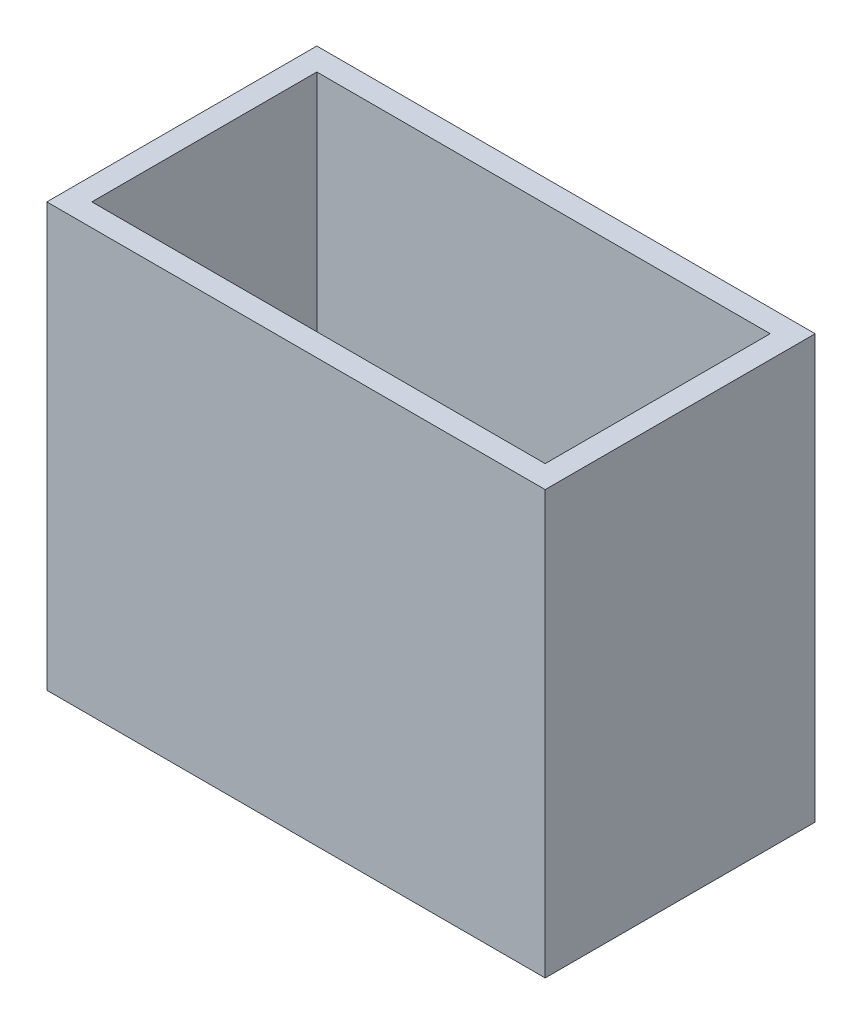
ISO-10303-21;
HEADER;
FILE_DESCRIPTION(('STEP AP214'),'2;1');
FILE_NAME('part.step','',(''),(''),'','','');
FILE_SCHEMA(('AUTOMOTIVE_DESIGN { 1 0 10303 214 1 1 1 1 }'));
ENDSEC;
DATA;
#1=APPLICATION_CONTEXT('core data for automotive mechanical design processes');
#2=APPLICATION_PROTOCOL_DEFINITION('international standard','automotive_design',2000,#1);
#3=PRODUCT_CONTEXT('',#1,'mechanical');
#4=PRODUCT('Part','Part','',(#3));
#5=PRODUCT_RELATED_PRODUCT_CATEGORY('part','',(#4));
#6=PRODUCT_DEFINITION_FORMATION('','',#4);
#7=PRODUCT_DEFINITION_CONTEXT('part definition',#1,'design');
#8=PRODUCT_DEFINITION('design','',#6,#7);
#9=PRODUCT_DEFINITION_SHAPE('','',#8);
#10=(LENGTH_UNIT() NAMED_UNIT(*) SI_UNIT(.MILLI.,.METRE.));
#11=(NAMED_UNIT(*) PLANE_ANGLE_UNIT() SI_UNIT($,.RADIAN.));
#12=(NAMED_UNIT(*) SI_UNIT($,.STERADIAN.) SOLID_ANGLE_UNIT());
#13=UNCERTAINTY_MEASURE_WITH_UNIT(LENGTH_MEASURE(1.E-05),#10,'distance_accuracy_value','');
#14=(GEOMETRIC_REPRESENTATION_CONTEXT(3) GLOBAL_UNCERTAINTY_ASSIGNED_CONTEXT((#13)) GLOBAL_UNIT_ASSIGNED_CONTEXT((#10,
#11,#12)) REPRESENTATION_CONTEXT('',''));
#15=CARTESIAN_POINT('',(0.,0.,0.));
#16=DIRECTION('',(0.,0.,1.));
#17=DIRECTION('',(1.,0.,0.));
#18=AXIS2_PLACEMENT_3D('',#15,#16,#17);
#19=CARTESIAN_POINT('',(0.,0.,24.));
#20=DIRECTION('',(1.,0.,0.));
#21=DIRECTION('',(0.,0.,-1.));
#22=AXIS2_PLACEMENT_3D('',#19,#20,#21);
#23=PLANE('',#22);
#24=DIRECTION('',(0.,-1.,0.));
#25=VECTOR('',#24,1.);
#26=CARTESIAN_POINT('',(0.,0.,0.));
#27=LINE('',#26,#25);
#28=CARTESIAN_POINT('',(0.,37.6,0.));
#29=VERTEX_POINT('',#28);
#30=CARTESIAN_POINT('',(0.,0.,0.));
#31=VERTEX_POINT('',#30);
#32=EDGE_CURVE('E160',#29,#31,#27,.T.);
#33=ORIENTED_EDGE('',*,*,#32,.T.);
#34=DIRECTION('',(0.,0.,-1.));
#35=VECTOR('',#34,1.);
#36=CARTESIAN_POINT('',(0.,0.,24.));
#37=LINE('',#36,#35);
#38=CARTESIAN_POINT('',(0.,0.,24.));
#39=VERTEX_POINT('',#38);
#40=EDGE_CURVE('E11',#39,#31,#37,.T.);
#41=ORIENTED_EDGE('',*,*,#40,.F.);
#42=DIRECTION('',(0.,-1.,0.));
#43=VECTOR('',#42,1.);
#44=CARTESIAN_POINT('',(0.,0.,24.));
#45=LINE('',#44,#43);
#46=CARTESIAN_POINT('',(0.,37.6,24.));
#47=VERTEX_POINT('',#46);
#48=EDGE_CURVE('E166',#47,#39,#45,.T.);
#49=ORIENTED_EDGE('',*,*,#48,.F.);
#50=DIRECTION('',(0.,0.,-1.));
#51=VECTOR('',#50,1.);
#52=CARTESIAN_POINT('',(0.,37.6,24.));
#53=LINE('',#52,#51);
#54=EDGE_CURVE('E176',#47,#29,#53,.T.);
#55=ORIENTED_EDGE('',*,*,#54,.T.);
#56=EDGE_LOOP('',(#33,#41,#49,#55));
#57=FACE_BOUND('',#56,.T.);
#58=ADVANCED_FACE('F41',(#57),#23,.F.);
#59=CARTESIAN_POINT('',(0.,0.,24.));
#60=DIRECTION('',(0.,1.,0.));
#61=DIRECTION('',(0.,0.,1.));
#62=AXIS2_PLACEMENT_3D('',#59,#60,#61);
#63=PLANE('',#62);
#64=DIRECTION('',(1.,0.,0.));
#65=VECTOR('',#64,1.);
#66=CARTESIAN_POINT('',(0.,0.,0.));
#67=LINE('',#66,#65);
#68=CARTESIAN_POINT('',(44.3,0.,0.));
#69=VERTEX_POINT('',#68);
#70=EDGE_CURVE('E180',#31,#69,#67,.T.);
#71=ORIENTED_EDGE('',*,*,#70,.T.);
#72=DIRECTION('',(0.,0.,-1.));
#73=VECTOR('',#72,1.);
#74=CARTESIAN_POINT('',(44.3,0.,24.));
#75=LINE('',#74,#73);
#76=CARTESIAN_POINT('',(44.3,0.,24.));
#77=VERTEX_POINT('',#76);
#78=EDGE_CURVE('E49',#77,#69,#75,.T.);
#79=ORIENTED_EDGE('',*,*,#78,.F.);
#80=DIRECTION('',(1.,0.,0.));
#81=VECTOR('',#80,1.);
#82=CARTESIAN_POINT('',(0.,0.,24.));
#83=LINE('',#82,#81);
#84=EDGE_CURVE('E93',#39,#77,#83,.T.);
#85=ORIENTED_EDGE('',*,*,#84,.F.);
#86=ORIENTED_EDGE('',*,*,#40,.T.);
#87=EDGE_LOOP('',(#71,#79,#85,#86));
#88=FACE_BOUND('',#87,.T.);
#89=ADVANCED_FACE('F215',(#88),#63,.F.);
#90=CARTESIAN_POINT('',(44.3,0.,24.));
#91=DIRECTION('',(-1.,0.,0.));
#92=DIRECTION('',(0.,0.,1.));
#93=AXIS2_PLACEMENT_3D('',#90,#91,#92);
#94=PLANE('',#93);
#95=DIRECTION('',(0.,1.,0.));
#96=VECTOR('',#95,1.);
#97=CARTESIAN_POINT('',(44.3,0.,0.));
#98=LINE('',#97,#96);
#99=CARTESIAN_POINT('',(44.3,37.6,0.));
#100=VERTEX_POINT('',#99);
#101=EDGE_CURVE('E183',#69,#100,#98,.T.);
#102=ORIENTED_EDGE('',*,*,#101,.T.);
#103=DIRECTION('',(0.,0.,-1.));
#104=VECTOR('',#103,1.);
#105=CARTESIAN_POINT('',(44.3,37.6,24.));
#106=LINE('',#105,#104);
#107=CARTESIAN_POINT('',(44.3,37.6,24.));
#108=VERTEX_POINT('',#107);
#109=EDGE_CURVE('E190',#108,#100,#106,.T.);
#110=ORIENTED_EDGE('',*,*,#109,.F.);
#111=DIRECTION('',(0.,1.,0.));
#112=VECTOR('',#111,1.);
#113=CARTESIAN_POINT('',(44.3,0.,24.));
#114=LINE('',#113,#112);
#115=EDGE_CURVE('E171',#77,#108,#114,.T.);
#116=ORIENTED_EDGE('',*,*,#115,.F.);
#117=ORIENTED_EDGE('',*,*,#78,.T.);
#118=EDGE_LOOP('',(#102,#110,#116,#117));
#119=FACE_BOUND('',#118,.T.);
#120=ADVANCED_FACE('F197',(#119),#94,.F.);
#121=CARTESIAN_POINT('',(0.,37.6,24.));
#122=DIRECTION('',(0.,-1.,0.));
#123=DIRECTION('',(0.,0.,-1.));
#124=AXIS2_PLACEMENT_3D('',#121,#122,#123);
#125=PLANE('',#124);
#126=DIRECTION('',(1.,0.,0.));
#127=VECTOR('',#126,1.);
#128=CARTESIAN_POINT('',(2.,37.6,22.));
#129=LINE('',#128,#127);
#130=CARTESIAN_POINT('',(2.,37.6,22.));
#131=VERTEX_POINT('',#130);
#132=CARTESIAN_POINT('',(42.3,37.6,22.));
#133=VERTEX_POINT('',#132);
#134=EDGE_CURVE('E151',#131,#133,#129,.T.);
#135=ORIENTED_EDGE('',*,*,#134,.F.);
#136=DIRECTION('',(0.,0.,1.));
#137=VECTOR('',#136,1.);
#138=CARTESIAN_POINT('',(2.,37.6,2.));
#139=LINE('',#138,#137);
#140=CARTESIAN_POINT('',(2.,37.6,2.));
#141=VERTEX_POINT('',#140);
#142=EDGE_CURVE('E56',#141,#131,#139,.T.);
#143=ORIENTED_EDGE('',*,*,#142,.F.);
#144=DIRECTION('',(-1.,0.,0.));
#145=VECTOR('',#144,1.);
#146=CARTESIAN_POINT('',(2.,37.6,2.));
#147=LINE('',#146,#145);
#148=CARTESIAN_POINT('',(42.3,37.6,2.));
#149=VERTEX_POINT('',#148);
#150=EDGE_CURVE('E138',#149,#141,#147,.T.);
#151=ORIENTED_EDGE('',*,*,#150,.F.);
#152=DIRECTION('',(0.,0.,-1.));
#153=VECTOR('',#152,1.);
#154=CARTESIAN_POINT('',(42.3,37.6,2.));
#155=LINE('',#154,#153);
#156=EDGE_CURVE('E142',#133,#149,#155,.T.);
#157=ORIENTED_EDGE('',*,*,#156,.F.);
#158=EDGE_LOOP('',(#135,#143,#151,#157));
#159=FACE_BOUND('',#158,.T.);
#160=DIRECTION('',(-1.,0.,0.));
#161=VECTOR('',#160,1.);
#162=CARTESIAN_POINT('',(0.,37.6,0.));
#163=LINE('',#162,#161);
#164=EDGE_CURVE('E86',#100,#29,#163,.T.);
#165=ORIENTED_EDGE('',*,*,#164,.T.);
#166=ORIENTED_EDGE('',*,*,#54,.F.);
#167=DIRECTION('',(-1.,0.,0.));
#168=VECTOR('',#167,1.);
#169=CARTESIAN_POINT('',(0.,37.6,24.));
#170=LINE('',#169,#168);
#171=EDGE_CURVE('E65',#108,#47,#170,.T.);
#172=ORIENTED_EDGE('',*,*,#171,.F.);
#173=ORIENTED_EDGE('',*,*,#109,.T.);
#174=EDGE_LOOP('',(#165,#166,#172,#173));
#175=FACE_BOUND('',#174,.T.);
#176=ADVANCED_FACE('F205',(#159,#175),#125,.F.);
#177=CARTESIAN_POINT('',(0.,0.,24.));
#178=DIRECTION('',(0.,0.,-1.));
#179=DIRECTION('',(-1.,0.,0.));
#180=AXIS2_PLACEMENT_3D('',#177,#178,#179);
#181=PLANE('',#180);
#182=ORIENTED_EDGE('',*,*,#48,.T.);
#183=ORIENTED_EDGE('',*,*,#84,.T.);
#184=ORIENTED_EDGE('',*,*,#115,.T.);
#185=ORIENTED_EDGE('',*,*,#171,.T.);
#186=EDGE_LOOP('',(#182,#183,#184,#185));
#187=FACE_BOUND('',#186,.T.);
#188=ADVANCED_FACE('F207',(#187),#181,.F.);
#189=CARTESIAN_POINT('',(0.,0.,0.));
#190=DIRECTION('',(0.,0.,-1.));
#191=DIRECTION('',(-1.,0.,0.));
#192=AXIS2_PLACEMENT_3D('',#189,#190,#191);
#193=PLANE('',#192);
#194=ORIENTED_EDGE('',*,*,#32,.F.);
#195=ORIENTED_EDGE('',*,*,#164,.F.);
#196=ORIENTED_EDGE('',*,*,#101,.F.);
#197=ORIENTED_EDGE('',*,*,#70,.F.);
#198=EDGE_LOOP('',(#194,#195,#196,#197));
#199=FACE_BOUND('',#198,.T.);
#200=ADVANCED_FACE('F201',(#199),#193,.T.);
#201=CARTESIAN_POINT('',(2.,1.,2.));
#202=DIRECTION('',(-1.,0.,0.));
#203=DIRECTION('',(0.,0.,1.));
#204=AXIS2_PLACEMENT_3D('',#201,#202,#203);
#205=PLANE('',#204);
#206=ORIENTED_EDGE('',*,*,#142,.T.);
#207=DIRECTION('',(0.,1.,0.));
#208=VECTOR('',#207,1.);
#209=CARTESIAN_POINT('',(2.,1.,22.));
#210=LINE('',#209,#208);
#211=CARTESIAN_POINT('',(2.,1.,22.));
#212=VERTEX_POINT('',#211);
#213=EDGE_CURVE('E113',#212,#131,#210,.T.);
#214=ORIENTED_EDGE('',*,*,#213,.F.);
#215=DIRECTION('',(0.,0.,1.));
#216=VECTOR('',#215,1.);
#217=CARTESIAN_POINT('',(2.,1.,2.));
#218=LINE('',#217,#216);
#219=CARTESIAN_POINT('',(2.,1.,2.));
#220=VERTEX_POINT('',#219);
#221=EDGE_CURVE('E117',#220,#212,#218,.T.);
#222=ORIENTED_EDGE('',*,*,#221,.F.);
#223=DIRECTION('',(0.,1.,0.));
#224=VECTOR('',#223,1.);
#225=CARTESIAN_POINT('',(2.,1.,2.));
#226=LINE('',#225,#224);
#227=EDGE_CURVE('E157',#220,#141,#226,.T.);
#228=ORIENTED_EDGE('',*,*,#227,.T.);
#229=EDGE_LOOP('',(#206,#214,#222,#228));
#230=FACE_BOUND('',#229,.T.);
#231=ADVANCED_FACE('F115',(#230),#205,.F.);
#232=CARTESIAN_POINT('',(2.,1.,2.));
#233=DIRECTION('',(0.,0.,-1.));
#234=DIRECTION('',(-1.,0.,0.));
#235=AXIS2_PLACEMENT_3D('',#232,#233,#234);
#236=PLANE('',#235);
#237=ORIENTED_EDGE('',*,*,#150,.T.);
#238=ORIENTED_EDGE('',*,*,#227,.F.);
#239=DIRECTION('',(-1.,0.,0.));
#240=VECTOR('',#239,1.);
#241=CARTESIAN_POINT('',(2.,1.,2.));
#242=LINE('',#241,#240);
#243=CARTESIAN_POINT('',(42.3,1.,2.));
#244=VERTEX_POINT('',#243);
#245=EDGE_CURVE('E124',#244,#220,#242,.T.);
#246=ORIENTED_EDGE('',*,*,#245,.F.);
#247=DIRECTION('',(0.,1.,0.));
#248=VECTOR('',#247,1.);
#249=CARTESIAN_POINT('',(42.3,1.,2.));
#250=LINE('',#249,#248);
#251=EDGE_CURVE('E161',#244,#149,#250,.T.);
#252=ORIENTED_EDGE('',*,*,#251,.T.);
#253=EDGE_LOOP('',(#237,#238,#246,#252));
#254=FACE_BOUND('',#253,.T.);
#255=ADVANCED_FACE('F254',(#254),#236,.F.);
#256=CARTESIAN_POINT('',(42.3,1.,2.));
#257=DIRECTION('',(1.,0.,0.));
#258=DIRECTION('',(0.,0.,-1.));
#259=AXIS2_PLACEMENT_3D('',#256,#257,#258);
#260=PLANE('',#259);
#261=ORIENTED_EDGE('',*,*,#156,.T.);
#262=ORIENTED_EDGE('',*,*,#251,.F.);
#263=DIRECTION('',(0.,0.,-1.));
#264=VECTOR('',#263,1.);
#265=CARTESIAN_POINT('',(42.3,1.,2.));
#266=LINE('',#265,#264);
#267=CARTESIAN_POINT('',(42.3,1.,22.));
#268=VERTEX_POINT('',#267);
#269=EDGE_CURVE('E133',#268,#244,#266,.T.);
#270=ORIENTED_EDGE('',*,*,#269,.F.);
#271=DIRECTION('',(0.,1.,0.));
#272=VECTOR('',#271,1.);
#273=CARTESIAN_POINT('',(42.3,1.,22.));
#274=LINE('',#273,#272);
#275=EDGE_CURVE('E123',#268,#133,#274,.T.);
#276=ORIENTED_EDGE('',*,*,#275,.T.);
#277=EDGE_LOOP('',(#261,#262,#270,#276));
#278=FACE_BOUND('',#277,.T.);
#279=ADVANCED_FACE('F263',(#278),#260,.F.);
#280=CARTESIAN_POINT('',(2.,1.,22.));
#281=DIRECTION('',(0.,0.,1.));
#282=DIRECTION('',(1.,0.,0.));
#283=AXIS2_PLACEMENT_3D('',#280,#281,#282);
#284=PLANE('',#283);
#285=ORIENTED_EDGE('',*,*,#134,.T.);
#286=ORIENTED_EDGE('',*,*,#275,.F.);
#287=DIRECTION('',(1.,0.,0.));
#288=VECTOR('',#287,1.);
#289=CARTESIAN_POINT('',(2.,1.,22.));
#290=LINE('',#289,#288);
#291=EDGE_CURVE('E127',#212,#268,#290,.T.);
#292=ORIENTED_EDGE('',*,*,#291,.F.);
#293=ORIENTED_EDGE('',*,*,#213,.T.);
#294=EDGE_LOOP('',(#285,#286,#292,#293));
#295=FACE_BOUND('',#294,.T.);
#296=ADVANCED_FACE('F128',(#295),#284,.F.);
#297=CARTESIAN_POINT('',(0.,1.,0.));
#298=DIRECTION('',(0.,1.,0.));
#299=DIRECTION('',(0.,0.,1.));
#300=AXIS2_PLACEMENT_3D('',#297,#298,#299);
#301=PLANE('',#300);
#302=ORIENTED_EDGE('',*,*,#221,.T.);
#303=ORIENTED_EDGE('',*,*,#291,.T.);
#304=ORIENTED_EDGE('',*,*,#269,.T.);
#305=ORIENTED_EDGE('',*,*,#245,.T.);
#306=EDGE_LOOP('',(#302,#303,#304,#305));
#307=FACE_BOUND('',#306,.T.);
#308=ADVANCED_FACE('F135',(#307),#301,.T.);
#309=CLOSED_SHELL('',(#58,#89,#120,#176,#188,#200,#231,#255,#279,#296,#308));
#310=MANIFOLD_SOLID_BREP('B2',#309);
#311=ADVANCED_BREP_SHAPE_REPRESENTATION('',(#18,#310),#14);
#312=SHAPE_DEFINITION_REPRESENTATION(#9,#311);
ENDSEC;
END-ISO-10303-21;
